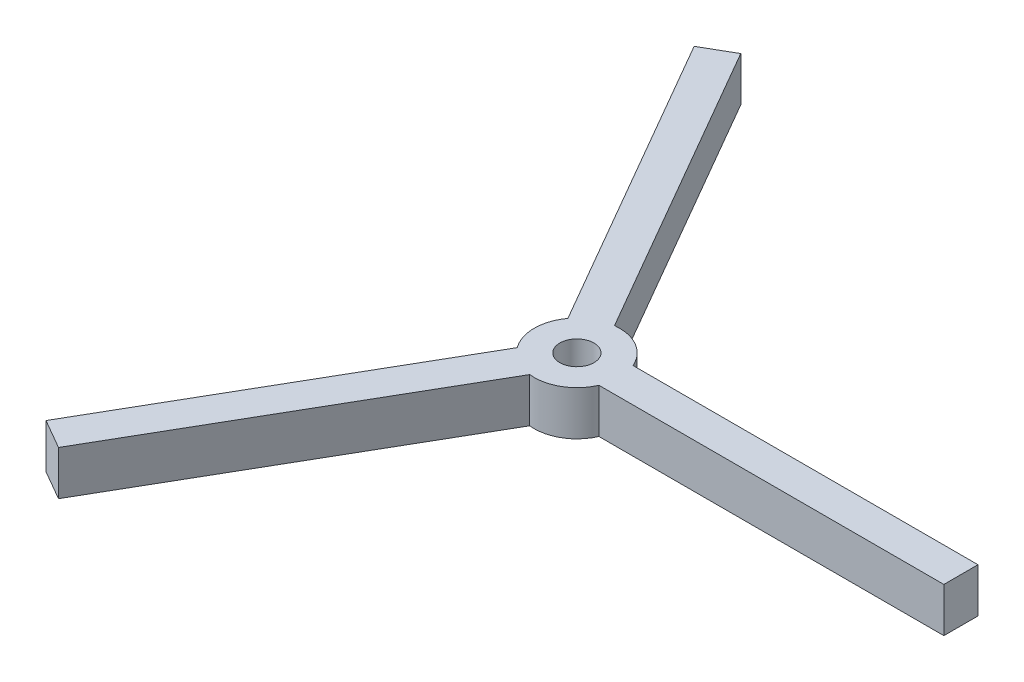
ISO-10303-21;
HEADER;
FILE_DESCRIPTION(('STEP AP214'),'2;1');
FILE_NAME('part.step','',(''),(''),'','','');
FILE_SCHEMA(('AUTOMOTIVE_DESIGN { 1 0 10303 214 1 1 1 1 }'));
ENDSEC;
DATA;
#1=APPLICATION_CONTEXT('core data for automotive mechanical design processes');
#2=APPLICATION_PROTOCOL_DEFINITION('international standard','automotive_design',2000,#1);
#3=PRODUCT_CONTEXT('',#1,'mechanical');
#4=PRODUCT('Part','Part','',(#3));
#5=PRODUCT_RELATED_PRODUCT_CATEGORY('part','',(#4));
#6=PRODUCT_DEFINITION_FORMATION('','',#4);
#7=PRODUCT_DEFINITION_CONTEXT('part definition',#1,'design');
#8=PRODUCT_DEFINITION('design','',#6,#7);
#9=PRODUCT_DEFINITION_SHAPE('','',#8);
#10=(LENGTH_UNIT() NAMED_UNIT(*) SI_UNIT(.MILLI.,.METRE.));
#11=(NAMED_UNIT(*) PLANE_ANGLE_UNIT() SI_UNIT($,.RADIAN.));
#12=(NAMED_UNIT(*) SI_UNIT($,.STERADIAN.) SOLID_ANGLE_UNIT());
#13=UNCERTAINTY_MEASURE_WITH_UNIT(LENGTH_MEASURE(1.E-05),#10,'distance_accuracy_value','');
#14=(GEOMETRIC_REPRESENTATION_CONTEXT(3) GLOBAL_UNCERTAINTY_ASSIGNED_CONTEXT((#13)) GLOBAL_UNIT_ASSIGNED_CONTEXT((#10,
#11,#12)) REPRESENTATION_CONTEXT('',''));
#15=CARTESIAN_POINT('',(0.,0.,0.));
#16=DIRECTION('',(0.,0.,1.));
#17=DIRECTION('',(1.,0.,0.));
#18=AXIS2_PLACEMENT_3D('',#15,#16,#17);
#19=CARTESIAN_POINT('',(0.,6.604,0.));
#20=DIRECTION('',(0.,-1.,0.));
#21=DIRECTION('',(0.,0.,-1.));
#22=AXIS2_PLACEMENT_3D('',#19,#20,#21);
#23=CYLINDRICAL_SURFACE('',#22,6.35);
#24=DIRECTION('',(0.,-1.,0.));
#25=VECTOR('',#24,1.);
#26=CARTESIAN_POINT('',(-5.1096400919094,6.604,3.77015624757809));
#27=LINE('',#26,#25);
#28=CARTESIAN_POINT('',(-5.1096400919094,6.604,3.77015624757809));
#29=VERTEX_POINT('',#28);
#30=CARTESIAN_POINT('',(-5.1096400919094,0.,3.77015624757809));
#31=VERTEX_POINT('',#30);
#32=EDGE_CURVE('E67',#29,#31,#27,.T.);
#33=ORIENTED_EDGE('',*,*,#32,.F.);
#34=CARTESIAN_POINT('',(0.,6.604,0.));
#35=DIRECTION('',(0.,1.,0.));
#36=DIRECTION('',(0.,0.,1.));
#37=AXIS2_PLACEMENT_3D('',#34,#35,#36);
#38=CIRCLE('',#37,6.35);
#39=CARTESIAN_POINT('',(-5.10964009190945,6.604,-3.77015624757802));
#40=VERTEX_POINT('',#39);
#41=EDGE_CURVE('E52',#40,#29,#38,.T.);
#42=ORIENTED_EDGE('',*,*,#41,.F.);
#43=DIRECTION('',(0.,-1.,0.));
#44=VECTOR('',#43,1.);
#45=CARTESIAN_POINT('',(-5.10964009190945,6.604,-3.77015624757802));
#46=LINE('',#45,#44);
#47=CARTESIAN_POINT('',(-5.10964009190945,0.,-3.77015624757802));
#48=VERTEX_POINT('',#47);
#49=EDGE_CURVE('E159',#48,#40,#46,.F.);
#50=ORIENTED_EDGE('',*,*,#49,.F.);
#51=CARTESIAN_POINT('',(0.,0.,0.));
#52=DIRECTION('',(0.,1.,0.));
#53=DIRECTION('',(0.,0.,1.));
#54=AXIS2_PLACEMENT_3D('',#51,#52,#53);
#55=CIRCLE('',#54,6.35);
#56=EDGE_CURVE('E144',#48,#31,#55,.T.);
#57=ORIENTED_EDGE('',*,*,#56,.T.);
#58=EDGE_LOOP('',(#33,#42,#50,#57));
#59=FACE_BOUND('',#58,.T.);
#60=ADVANCED_FACE('F43',(#59),#23,.T.);
#61=DIRECTION('',(0.,-1.,0.));
#62=VECTOR('',#61,1.);
#63=CARTESIAN_POINT('',(-0.71023104068442,6.604,6.31015624757805));
#64=LINE('',#63,#62);
#65=CARTESIAN_POINT('',(-0.710231040684421,0.,6.31015624757805));
#66=VERTEX_POINT('',#65);
#67=CARTESIAN_POINT('',(-0.71023104068442,6.604,6.31015624757805));
#68=VERTEX_POINT('',#67);
#69=EDGE_CURVE('E147',#66,#68,#64,.F.);
#70=ORIENTED_EDGE('',*,*,#69,.F.);
#71=CARTESIAN_POINT('',(5.81987113259392,0.,2.54));
#72=VERTEX_POINT('',#71);
#73=EDGE_CURVE('E134',#66,#72,#55,.T.);
#74=ORIENTED_EDGE('',*,*,#73,.T.);
#75=DIRECTION('',(0.,-1.,0.));
#76=VECTOR('',#75,1.);
#77=CARTESIAN_POINT('',(5.81987113259392,6.604,2.54));
#78=LINE('',#77,#76);
#79=CARTESIAN_POINT('',(5.81987113259392,6.604,2.54));
#80=VERTEX_POINT('',#79);
#81=EDGE_CURVE('E191',#80,#72,#78,.T.);
#82=ORIENTED_EDGE('',*,*,#81,.F.);
#83=EDGE_CURVE('E53',#68,#80,#38,.T.);
#84=ORIENTED_EDGE('',*,*,#83,.F.);
#85=EDGE_LOOP('',(#70,#74,#82,#84));
#86=FACE_BOUND('',#85,.T.);
#87=ADVANCED_FACE('F148',(#86),#23,.T.);
#88=DIRECTION('',(0.,-1.,0.));
#89=VECTOR('',#88,1.);
#90=CARTESIAN_POINT('',(-0.710231040684515,6.604,-6.31015624757804));
#91=LINE('',#90,#89);
#92=CARTESIAN_POINT('',(-0.710231040684515,6.604,-6.31015624757804));
#93=VERTEX_POINT('',#92);
#94=CARTESIAN_POINT('',(-0.710231040684515,0.,-6.31015624757804));
#95=VERTEX_POINT('',#94);
#96=EDGE_CURVE('E167',#93,#95,#91,.T.);
#97=ORIENTED_EDGE('',*,*,#96,.F.);
#98=CARTESIAN_POINT('',(5.81987113259392,6.604,-2.54));
#99=VERTEX_POINT('',#98);
#100=EDGE_CURVE('E11',#99,#93,#38,.T.);
#101=ORIENTED_EDGE('',*,*,#100,.F.);
#102=DIRECTION('',(0.,-1.,0.));
#103=VECTOR('',#102,1.);
#104=CARTESIAN_POINT('',(5.81987113259392,6.604,-2.54));
#105=LINE('',#104,#103);
#106=CARTESIAN_POINT('',(5.81987113259392,0.,-2.54));
#107=VERTEX_POINT('',#106);
#108=EDGE_CURVE('E193',#107,#99,#105,.F.);
#109=ORIENTED_EDGE('',*,*,#108,.F.);
#110=EDGE_CURVE('E47',#107,#95,#55,.T.);
#111=ORIENTED_EDGE('',*,*,#110,.T.);
#112=EDGE_LOOP('',(#97,#101,#109,#111));
#113=FACE_BOUND('',#112,.T.);
#114=ADVANCED_FACE('F45',(#113),#23,.T.);
#115=CARTESIAN_POINT('',(0.,6.604,0.));
#116=DIRECTION('',(0.,1.,0.));
#117=DIRECTION('',(0.,0.,1.));
#118=AXIS2_PLACEMENT_3D('',#115,#116,#117);
#119=PLANE('',#118);
#120=ORIENTED_EDGE('',*,*,#100,.T.);
#121=DIRECTION('',(0.500000000000004,0.,0.866025403784436));
#122=VECTOR('',#121,1.);
#123=CARTESIAN_POINT('',(-26.3752954743878,6.604,-50.7633518262805));
#124=LINE('',#123,#122);
#125=CARTESIAN_POINT('',(-26.3752954743878,6.604,-50.7633518262805));
#126=VERTEX_POINT('',#125);
#127=EDGE_CURVE('E179',#126,#93,#124,.T.);
#128=ORIENTED_EDGE('',*,*,#127,.F.);
#129=DIRECTION('',(0.866025403784436,0.,-0.500000000000004));
#130=VECTOR('',#129,1.);
#131=CARTESIAN_POINT('',(-26.3752954743878,6.604,-50.7633518262805));
#132=LINE('',#131,#130);
#133=CARTESIAN_POINT('',(-30.7747045256127,6.604,-48.2233518262805));
#134=VERTEX_POINT('',#133);
#135=EDGE_CURVE('E177',#134,#126,#132,.T.);
#136=ORIENTED_EDGE('',*,*,#135,.F.);
#137=DIRECTION('',(0.500000000000004,0.,0.866025403784436));
#138=VECTOR('',#137,1.);
#139=CARTESIAN_POINT('',(-30.7747045256127,6.604,-48.2233518262805));
#140=LINE('',#139,#138);
#141=EDGE_CURVE('E182',#134,#40,#140,.T.);
#142=ORIENTED_EDGE('',*,*,#141,.T.);
#143=ORIENTED_EDGE('',*,*,#41,.T.);
#144=DIRECTION('',(0.499999999999992,0.,-0.866025403784443));
#145=VECTOR('',#144,1.);
#146=CARTESIAN_POINT('',(-30.774704525612,6.604,48.223351826281));
#147=LINE('',#146,#145);
#148=CARTESIAN_POINT('',(-30.774704525612,6.604,48.223351826281));
#149=VERTEX_POINT('',#148);
#150=EDGE_CURVE('E161',#149,#29,#147,.T.);
#151=ORIENTED_EDGE('',*,*,#150,.F.);
#152=DIRECTION('',(-0.866025403784443,0.,-0.499999999999992));
#153=VECTOR('',#152,1.);
#154=CARTESIAN_POINT('',(-30.774704525612,6.604,48.223351826281));
#155=LINE('',#154,#153);
#156=CARTESIAN_POINT('',(-26.3752954743871,6.604,50.7633518262809));
#157=VERTEX_POINT('',#156);
#158=EDGE_CURVE('E284',#157,#149,#155,.T.);
#159=ORIENTED_EDGE('',*,*,#158,.F.);
#160=DIRECTION('',(0.499999999999992,0.,-0.866025403784443));
#161=VECTOR('',#160,1.);
#162=CARTESIAN_POINT('',(-26.3752954743871,6.604,50.7633518262809));
#163=LINE('',#162,#161);
#164=EDGE_CURVE('E156',#157,#68,#163,.T.);
#165=ORIENTED_EDGE('',*,*,#164,.T.);
#166=ORIENTED_EDGE('',*,*,#83,.T.);
#167=DIRECTION('',(-1.,0.,0.));
#168=VECTOR('',#167,1.);
#169=CARTESIAN_POINT('',(57.15,6.604,2.54));
#170=LINE('',#169,#168);
#171=CARTESIAN_POINT('',(57.15,6.604,2.54));
#172=VERTEX_POINT('',#171);
#173=EDGE_CURVE('E204',#172,#80,#170,.T.);
#174=ORIENTED_EDGE('',*,*,#173,.F.);
#175=DIRECTION('',(0.,0.,1.));
#176=VECTOR('',#175,1.);
#177=CARTESIAN_POINT('',(57.15,6.604,2.54));
#178=LINE('',#177,#176);
#179=CARTESIAN_POINT('',(57.15,6.604,-2.54));
#180=VERTEX_POINT('',#179);
#181=EDGE_CURVE('E202',#180,#172,#178,.T.);
#182=ORIENTED_EDGE('',*,*,#181,.F.);
#183=DIRECTION('',(-1.,0.,0.));
#184=VECTOR('',#183,1.);
#185=CARTESIAN_POINT('',(57.15,6.604,-2.54));
#186=LINE('',#185,#184);
#187=EDGE_CURVE('E207',#180,#99,#186,.T.);
#188=ORIENTED_EDGE('',*,*,#187,.T.);
#189=EDGE_LOOP('',(#120,#128,#136,#142,#143,#151,#159,#165,#166,#174,#182,#188));
#190=FACE_BOUND('',#189,.T.);
#191=CARTESIAN_POINT('',(0.,6.604,0.));
#192=DIRECTION('',(0.,1.,0.));
#193=DIRECTION('',(0.,0.,1.));
#194=AXIS2_PLACEMENT_3D('',#191,#192,#193);
#195=CIRCLE('',#194,2.54);
#196=CARTESIAN_POINT('',(0.,6.604,2.54));
#197=VERTEX_POINT('',#196);
#198=EDGE_CURVE('E145',#197,#197,#195,.T.);
#199=ORIENTED_EDGE('',*,*,#198,.F.);
#200=EDGE_LOOP('',(#199));
#201=FACE_BOUND('',#200,.T.);
#202=ADVANCED_FACE('F231',(#190,#201),#119,.T.);
#203=CARTESIAN_POINT('',(0.,0.,0.));
#204=DIRECTION('',(0.,1.,0.));
#205=DIRECTION('',(0.,0.,1.));
#206=AXIS2_PLACEMENT_3D('',#203,#204,#205);
#207=PLANE('',#206);
#208=ORIENTED_EDGE('',*,*,#110,.F.);
#209=DIRECTION('',(-1.,0.,0.));
#210=VECTOR('',#209,1.);
#211=CARTESIAN_POINT('',(57.15,0.,-2.54));
#212=LINE('',#211,#210);
#213=CARTESIAN_POINT('',(57.15,0.,-2.54));
#214=VERTEX_POINT('',#213);
#215=EDGE_CURVE('E210',#214,#107,#212,.T.);
#216=ORIENTED_EDGE('',*,*,#215,.F.);
#217=DIRECTION('',(0.,0.,-1.));
#218=VECTOR('',#217,1.);
#219=CARTESIAN_POINT('',(57.15,0.,2.54));
#220=LINE('',#219,#218);
#221=CARTESIAN_POINT('',(57.15,0.,2.54));
#222=VERTEX_POINT('',#221);
#223=EDGE_CURVE('E198',#222,#214,#220,.T.);
#224=ORIENTED_EDGE('',*,*,#223,.F.);
#225=DIRECTION('',(-1.,0.,0.));
#226=VECTOR('',#225,1.);
#227=CARTESIAN_POINT('',(57.15,0.,2.54));
#228=LINE('',#227,#226);
#229=EDGE_CURVE('E142',#222,#72,#228,.T.);
#230=ORIENTED_EDGE('',*,*,#229,.T.);
#231=ORIENTED_EDGE('',*,*,#73,.F.);
#232=DIRECTION('',(0.499999999999992,0.,-0.866025403784443));
#233=VECTOR('',#232,1.);
#234=CARTESIAN_POINT('',(-26.3752954743871,0.,50.7633518262809));
#235=LINE('',#234,#233);
#236=CARTESIAN_POINT('',(-26.3752954743871,0.,50.7633518262809));
#237=VERTEX_POINT('',#236);
#238=EDGE_CURVE('E139',#237,#66,#235,.T.);
#239=ORIENTED_EDGE('',*,*,#238,.F.);
#240=DIRECTION('',(0.866025403784443,0.,0.499999999999992));
#241=VECTOR('',#240,1.);
#242=CARTESIAN_POINT('',(-30.774704525612,0.,48.223351826281));
#243=LINE('',#242,#241);
#244=CARTESIAN_POINT('',(-30.774704525612,0.,48.223351826281));
#245=VERTEX_POINT('',#244);
#246=EDGE_CURVE('E274',#245,#237,#243,.T.);
#247=ORIENTED_EDGE('',*,*,#246,.F.);
#248=DIRECTION('',(0.499999999999992,0.,-0.866025403784443));
#249=VECTOR('',#248,1.);
#250=CARTESIAN_POINT('',(-30.774704525612,0.,48.223351826281));
#251=LINE('',#250,#249);
#252=EDGE_CURVE('E155',#245,#31,#251,.T.);
#253=ORIENTED_EDGE('',*,*,#252,.T.);
#254=ORIENTED_EDGE('',*,*,#56,.F.);
#255=DIRECTION('',(0.500000000000004,0.,0.866025403784436));
#256=VECTOR('',#255,1.);
#257=CARTESIAN_POINT('',(-30.7747045256127,0.,-48.2233518262805));
#258=LINE('',#257,#256);
#259=CARTESIAN_POINT('',(-30.7747045256127,0.,-48.2233518262805));
#260=VERTEX_POINT('',#259);
#261=EDGE_CURVE('E185',#260,#48,#258,.T.);
#262=ORIENTED_EDGE('',*,*,#261,.F.);
#263=DIRECTION('',(-0.866025403784436,0.,0.500000000000004));
#264=VECTOR('',#263,1.);
#265=CARTESIAN_POINT('',(-26.3752954743878,0.,-50.7633518262805));
#266=LINE('',#265,#264);
#267=CARTESIAN_POINT('',(-26.3752954743878,0.,-50.7633518262805));
#268=VERTEX_POINT('',#267);
#269=EDGE_CURVE('E173',#268,#260,#266,.T.);
#270=ORIENTED_EDGE('',*,*,#269,.F.);
#271=DIRECTION('',(0.500000000000004,0.,0.866025403784436));
#272=VECTOR('',#271,1.);
#273=CARTESIAN_POINT('',(-26.3752954743878,0.,-50.7633518262805));
#274=LINE('',#273,#272);
#275=EDGE_CURVE('E188',#268,#95,#274,.T.);
#276=ORIENTED_EDGE('',*,*,#275,.T.);
#277=EDGE_LOOP('',(#208,#216,#224,#230,#231,#239,#247,#253,#254,#262,#270,#276));
#278=FACE_BOUND('',#277,.T.);
#279=CARTESIAN_POINT('',(0.,0.,0.));
#280=DIRECTION('',(0.,1.,0.));
#281=DIRECTION('',(0.,0.,1.));
#282=AXIS2_PLACEMENT_3D('',#279,#280,#281);
#283=CIRCLE('',#282,2.54);
#284=CARTESIAN_POINT('',(0.,0.,2.54));
#285=VERTEX_POINT('',#284);
#286=EDGE_CURVE('E213',#285,#285,#283,.T.);
#287=ORIENTED_EDGE('',*,*,#286,.T.);
#288=EDGE_LOOP('',(#287));
#289=FACE_BOUND('',#288,.T.);
#290=ADVANCED_FACE('F136',(#278,#289),#207,.F.);
#291=CARTESIAN_POINT('',(0.,6.604,0.));
#292=DIRECTION('',(0.,-1.,0.));
#293=DIRECTION('',(0.,0.,-1.));
#294=AXIS2_PLACEMENT_3D('',#291,#292,#293);
#295=CYLINDRICAL_SURFACE('',#294,2.54);
#296=ORIENTED_EDGE('',*,*,#198,.T.);
#297=EDGE_LOOP('',(#296));
#298=FACE_BOUND('',#297,.T.);
#299=ORIENTED_EDGE('',*,*,#286,.F.);
#300=EDGE_LOOP('',(#299));
#301=FACE_BOUND('',#300,.T.);
#302=ADVANCED_FACE('F219',(#298,#301),#295,.F.);
#303=CARTESIAN_POINT('',(57.15,0.,2.54));
#304=DIRECTION('',(0.,0.,-1.));
#305=DIRECTION('',(-1.,0.,0.));
#306=AXIS2_PLACEMENT_3D('',#303,#304,#305);
#307=PLANE('',#306);
#308=ORIENTED_EDGE('',*,*,#173,.T.);
#309=ORIENTED_EDGE('',*,*,#81,.T.);
#310=ORIENTED_EDGE('',*,*,#229,.F.);
#311=DIRECTION('',(0.,-1.,0.));
#312=VECTOR('',#311,1.);
#313=CARTESIAN_POINT('',(57.15,0.,2.54));
#314=LINE('',#313,#312);
#315=EDGE_CURVE('E195',#172,#222,#314,.T.);
#316=ORIENTED_EDGE('',*,*,#315,.F.);
#317=EDGE_LOOP('',(#308,#309,#310,#316));
#318=FACE_BOUND('',#317,.T.);
#319=ADVANCED_FACE('F221',(#318),#307,.F.);
#320=CARTESIAN_POINT('',(57.15,0.,-2.54));
#321=DIRECTION('',(0.,0.,1.));
#322=DIRECTION('',(0.,-1.,0.));
#323=AXIS2_PLACEMENT_3D('',#320,#321,#322);
#324=PLANE('',#323);
#325=ORIENTED_EDGE('',*,*,#215,.T.);
#326=ORIENTED_EDGE('',*,*,#108,.T.);
#327=ORIENTED_EDGE('',*,*,#187,.F.);
#328=DIRECTION('',(0.,1.,0.));
#329=VECTOR('',#328,1.);
#330=CARTESIAN_POINT('',(57.15,0.,-2.54));
#331=LINE('',#330,#329);
#332=EDGE_CURVE('E200',#214,#180,#331,.T.);
#333=ORIENTED_EDGE('',*,*,#332,.F.);
#334=EDGE_LOOP('',(#325,#326,#327,#333));
#335=FACE_BOUND('',#334,.T.);
#336=ADVANCED_FACE('F227',(#335),#324,.F.);
#337=CARTESIAN_POINT('',(57.15,0.,0.));
#338=DIRECTION('',(-1.,0.,0.));
#339=DIRECTION('',(0.,0.,1.));
#340=AXIS2_PLACEMENT_3D('',#337,#338,#339);
#341=PLANE('',#340);
#342=ORIENTED_EDGE('',*,*,#315,.T.);
#343=ORIENTED_EDGE('',*,*,#223,.T.);
#344=ORIENTED_EDGE('',*,*,#332,.T.);
#345=ORIENTED_EDGE('',*,*,#181,.T.);
#346=EDGE_LOOP('',(#342,#343,#344,#345));
#347=FACE_BOUND('',#346,.T.);
#348=ADVANCED_FACE('F269',(#347),#341,.F.);
#349=CARTESIAN_POINT('',(-26.3752954743878,0.,-50.7633518262805));
#350=DIRECTION('',(-0.866025403784436,0.,0.500000000000004));
#351=DIRECTION('',(0.500000000000004,0.,0.866025403784436));
#352=AXIS2_PLACEMENT_3D('',#349,#350,#351);
#353=PLANE('',#352);
#354=ORIENTED_EDGE('',*,*,#127,.T.);
#355=ORIENTED_EDGE('',*,*,#96,.T.);
#356=ORIENTED_EDGE('',*,*,#275,.F.);
#357=DIRECTION('',(0.,-1.,0.));
#358=VECTOR('',#357,1.);
#359=CARTESIAN_POINT('',(-26.3752954743878,0.,-50.7633518262805));
#360=LINE('',#359,#358);
#361=EDGE_CURVE('E170',#126,#268,#360,.T.);
#362=ORIENTED_EDGE('',*,*,#361,.F.);
#363=EDGE_LOOP('',(#354,#355,#356,#362));
#364=FACE_BOUND('',#363,.T.);
#365=ADVANCED_FACE('F254',(#364),#353,.F.);
#366=CARTESIAN_POINT('',(-30.7747045256127,0.,-48.2233518262805));
#367=DIRECTION('',(0.866025403784436,0.,-0.500000000000004));
#368=DIRECTION('',(-0.500000000000004,0.,-0.866025403784436));
#369=AXIS2_PLACEMENT_3D('',#366,#367,#368);
#370=PLANE('',#369);
#371=ORIENTED_EDGE('',*,*,#261,.T.);
#372=ORIENTED_EDGE('',*,*,#49,.T.);
#373=ORIENTED_EDGE('',*,*,#141,.F.);
#374=DIRECTION('',(0.,1.,0.));
#375=VECTOR('',#374,1.);
#376=CARTESIAN_POINT('',(-30.7747045256127,0.,-48.2233518262805));
#377=LINE('',#376,#375);
#378=EDGE_CURVE('E175',#260,#134,#377,.T.);
#379=ORIENTED_EDGE('',*,*,#378,.F.);
#380=EDGE_LOOP('',(#371,#372,#373,#379));
#381=FACE_BOUND('',#380,.T.);
#382=ADVANCED_FACE('F264',(#381),#370,.F.);
#383=CARTESIAN_POINT('',(-28.5750000000002,0.,-49.4933518262805));
#384=DIRECTION('',(0.500000000000004,0.,0.866025403784436));
#385=DIRECTION('',(0.866025403784436,0.,-0.500000000000004));
#386=AXIS2_PLACEMENT_3D('',#383,#384,#385);
#387=PLANE('',#386);
#388=ORIENTED_EDGE('',*,*,#361,.T.);
#389=ORIENTED_EDGE('',*,*,#269,.T.);
#390=ORIENTED_EDGE('',*,*,#378,.T.);
#391=ORIENTED_EDGE('',*,*,#135,.T.);
#392=EDGE_LOOP('',(#388,#389,#390,#391));
#393=FACE_BOUND('',#392,.T.);
#394=ADVANCED_FACE('F256',(#393),#387,.F.);
#395=CARTESIAN_POINT('',(-30.774704525612,0.,48.223351826281));
#396=DIRECTION('',(0.866025403784443,0.,0.499999999999992));
#397=DIRECTION('',(0.499999999999992,0.,-0.866025403784443));
#398=AXIS2_PLACEMENT_3D('',#395,#396,#397);
#399=PLANE('',#398);
#400=ORIENTED_EDGE('',*,*,#150,.T.);
#401=ORIENTED_EDGE('',*,*,#32,.T.);
#402=ORIENTED_EDGE('',*,*,#252,.F.);
#403=DIRECTION('',(0.,-1.,0.));
#404=VECTOR('',#403,1.);
#405=CARTESIAN_POINT('',(-30.774704525612,0.,48.223351826281));
#406=LINE('',#405,#404);
#407=EDGE_CURVE('E151',#149,#245,#406,.T.);
#408=ORIENTED_EDGE('',*,*,#407,.F.);
#409=EDGE_LOOP('',(#400,#401,#402,#408));
#410=FACE_BOUND('',#409,.T.);
#411=ADVANCED_FACE('F278',(#410),#399,.F.);
#412=CARTESIAN_POINT('',(-26.3752954743871,0.,50.7633518262809));
#413=DIRECTION('',(-0.866025403784443,0.,-0.499999999999992));
#414=DIRECTION('',(-0.499999999999992,0.,0.866025403784443));
#415=AXIS2_PLACEMENT_3D('',#412,#413,#414);
#416=PLANE('',#415);
#417=ORIENTED_EDGE('',*,*,#238,.T.);
#418=ORIENTED_EDGE('',*,*,#69,.T.);
#419=ORIENTED_EDGE('',*,*,#164,.F.);
#420=DIRECTION('',(0.,1.,0.));
#421=VECTOR('',#420,1.);
#422=CARTESIAN_POINT('',(-26.3752954743871,0.,50.7633518262809));
#423=LINE('',#422,#421);
#424=EDGE_CURVE('E154',#237,#157,#423,.T.);
#425=ORIENTED_EDGE('',*,*,#424,.F.);
#426=EDGE_LOOP('',(#417,#418,#419,#425));
#427=FACE_BOUND('',#426,.T.);
#428=ADVANCED_FACE('F153',(#427),#416,.F.);
#429=CARTESIAN_POINT('',(-28.5749999999995,0.,49.4933518262809));
#430=DIRECTION('',(0.499999999999992,0.,-0.866025403784443));
#431=DIRECTION('',(-0.866025403784443,0.,-0.499999999999992));
#432=AXIS2_PLACEMENT_3D('',#429,#430,#431);
#433=PLANE('',#432);
#434=ORIENTED_EDGE('',*,*,#407,.T.);
#435=ORIENTED_EDGE('',*,*,#246,.T.);
#436=ORIENTED_EDGE('',*,*,#424,.T.);
#437=ORIENTED_EDGE('',*,*,#158,.T.);
#438=EDGE_LOOP('',(#434,#435,#436,#437));
#439=FACE_BOUND('',#438,.T.);
#440=ADVANCED_FACE('F286',(#439),#433,.F.);
#441=CLOSED_SHELL('',(#60,#87,#114,#202,#290,#302,#319,#336,#348,#365,#382,#394,#411,#428,#440));
#442=MANIFOLD_SOLID_BREP('B2',#441);
#443=ADVANCED_BREP_SHAPE_REPRESENTATION('',(#18,#442),#14);
#444=SHAPE_DEFINITION_REPRESENTATION(#9,#443);
ENDSEC;
END-ISO-10303-21;
